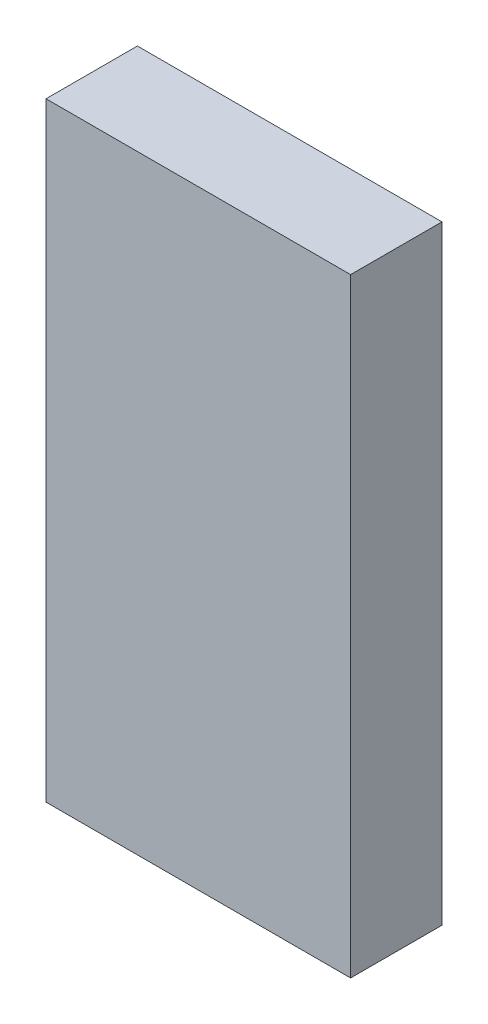
ISO-10303-21;
HEADER;
FILE_DESCRIPTION(('STEP AP214'),'2;1');
FILE_NAME('part.step','',(''),(''),'','','');
FILE_SCHEMA(('AUTOMOTIVE_DESIGN { 1 0 10303 214 1 1 1 1 }'));
ENDSEC;
DATA;
#1=APPLICATION_CONTEXT('core data for automotive mechanical design processes');
#2=APPLICATION_PROTOCOL_DEFINITION('international standard','automotive_design',2000,#1);
#3=PRODUCT_CONTEXT('',#1,'mechanical');
#4=PRODUCT('Part','Part','',(#3));
#5=PRODUCT_RELATED_PRODUCT_CATEGORY('part','',(#4));
#6=PRODUCT_DEFINITION_FORMATION('','',#4);
#7=PRODUCT_DEFINITION_CONTEXT('part definition',#1,'design');
#8=PRODUCT_DEFINITION('design','',#6,#7);
#9=PRODUCT_DEFINITION_SHAPE('','',#8);
#10=(LENGTH_UNIT() NAMED_UNIT(*) SI_UNIT(.MILLI.,.METRE.));
#11=(NAMED_UNIT(*) PLANE_ANGLE_UNIT() SI_UNIT($,.RADIAN.));
#12=(NAMED_UNIT(*) SI_UNIT($,.STERADIAN.) SOLID_ANGLE_UNIT());
#13=UNCERTAINTY_MEASURE_WITH_UNIT(LENGTH_MEASURE(1.E-05),#10,'distance_accuracy_value','');
#14=(GEOMETRIC_REPRESENTATION_CONTEXT(3) GLOBAL_UNCERTAINTY_ASSIGNED_CONTEXT((#13)) GLOBAL_UNIT_ASSIGNED_CONTEXT((#10,
#11,#12)) REPRESENTATION_CONTEXT('',''));
#15=CARTESIAN_POINT('',(0.,0.,0.));
#16=DIRECTION('',(0.,0.,1.));
#17=DIRECTION('',(1.,0.,0.));
#18=AXIS2_PLACEMENT_3D('',#15,#16,#17);
#19=CARTESIAN_POINT('',(12.7,-25.4,7.62));
#20=DIRECTION('',(-1.,0.,0.));
#21=DIRECTION('',(0.,0.,1.));
#22=AXIS2_PLACEMENT_3D('',#19,#20,#21);
#23=PLANE('',#22);
#24=DIRECTION('',(0.,1.,0.));
#25=VECTOR('',#24,1.);
#26=CARTESIAN_POINT('',(12.7,-25.4,0.));
#27=LINE('',#26,#25);
#28=CARTESIAN_POINT('',(12.7,-25.4,0.));
#29=VERTEX_POINT('',#28);
#30=CARTESIAN_POINT('',(12.7,25.4,0.));
#31=VERTEX_POINT('',#30);
#32=EDGE_CURVE('E111',#29,#31,#27,.T.);
#33=ORIENTED_EDGE('',*,*,#32,.T.);
#34=DIRECTION('',(0.,0.,-1.));
#35=VECTOR('',#34,1.);
#36=CARTESIAN_POINT('',(12.7,25.4,7.62));
#37=LINE('',#36,#35);
#38=CARTESIAN_POINT('',(12.7,25.4,7.62));
#39=VERTEX_POINT('',#38);
#40=EDGE_CURVE('E11',#39,#31,#37,.T.);
#41=ORIENTED_EDGE('',*,*,#40,.F.);
#42=DIRECTION('',(0.,1.,0.));
#43=VECTOR('',#42,1.);
#44=CARTESIAN_POINT('',(12.7,-25.4,7.62));
#45=LINE('',#44,#43);
#46=CARTESIAN_POINT('',(12.7,-25.4,7.62));
#47=VERTEX_POINT('',#46);
#48=EDGE_CURVE('E95',#47,#39,#45,.T.);
#49=ORIENTED_EDGE('',*,*,#48,.F.);
#50=DIRECTION('',(0.,0.,-1.));
#51=VECTOR('',#50,1.);
#52=CARTESIAN_POINT('',(12.7,-25.4,7.62));
#53=LINE('',#52,#51);
#54=EDGE_CURVE('E107',#47,#29,#53,.T.);
#55=ORIENTED_EDGE('',*,*,#54,.T.);
#56=EDGE_LOOP('',(#33,#41,#49,#55));
#57=FACE_BOUND('',#56,.T.);
#58=ADVANCED_FACE('F43',(#57),#23,.F.);
#59=CARTESIAN_POINT('',(-12.7,25.4,7.62));
#60=DIRECTION('',(0.,-1.,0.));
#61=DIRECTION('',(0.,0.,-1.));
#62=AXIS2_PLACEMENT_3D('',#59,#60,#61);
#63=PLANE('',#62);
#64=DIRECTION('',(-1.,0.,0.));
#65=VECTOR('',#64,1.);
#66=CARTESIAN_POINT('',(-12.7,25.4,0.));
#67=LINE('',#66,#65);
#68=CARTESIAN_POINT('',(-12.7,25.4,0.));
#69=VERTEX_POINT('',#68);
#70=EDGE_CURVE('E100',#31,#69,#67,.T.);
#71=ORIENTED_EDGE('',*,*,#70,.T.);
#72=DIRECTION('',(0.,0.,-1.));
#73=VECTOR('',#72,1.);
#74=CARTESIAN_POINT('',(-12.7,25.4,7.62));
#75=LINE('',#74,#73);
#76=CARTESIAN_POINT('',(-12.7,25.4,7.62));
#77=VERTEX_POINT('',#76);
#78=EDGE_CURVE('E52',#77,#69,#75,.T.);
#79=ORIENTED_EDGE('',*,*,#78,.F.);
#80=DIRECTION('',(-1.,0.,0.));
#81=VECTOR('',#80,1.);
#82=CARTESIAN_POINT('',(-12.7,25.4,7.62));
#83=LINE('',#82,#81);
#84=EDGE_CURVE('E90',#39,#77,#83,.T.);
#85=ORIENTED_EDGE('',*,*,#84,.F.);
#86=ORIENTED_EDGE('',*,*,#40,.T.);
#87=EDGE_LOOP('',(#71,#79,#85,#86));
#88=FACE_BOUND('',#87,.T.);
#89=ADVANCED_FACE('F99',(#88),#63,.F.);
#90=CARTESIAN_POINT('',(-12.7,-25.4,7.62));
#91=DIRECTION('',(1.,0.,0.));
#92=DIRECTION('',(0.,0.,-1.));
#93=AXIS2_PLACEMENT_3D('',#90,#91,#92);
#94=PLANE('',#93);
#95=DIRECTION('',(0.,-1.,0.));
#96=VECTOR('',#95,1.);
#97=CARTESIAN_POINT('',(-12.7,-25.4,0.));
#98=LINE('',#97,#96);
#99=CARTESIAN_POINT('',(-12.7,-25.4,0.));
#100=VERTEX_POINT('',#99);
#101=EDGE_CURVE('E77',#69,#100,#98,.T.);
#102=ORIENTED_EDGE('',*,*,#101,.T.);
#103=DIRECTION('',(0.,0.,-1.));
#104=VECTOR('',#103,1.);
#105=CARTESIAN_POINT('',(-12.7,-25.4,7.62));
#106=LINE('',#105,#104);
#107=CARTESIAN_POINT('',(-12.7,-25.4,7.62));
#108=VERTEX_POINT('',#107);
#109=EDGE_CURVE('E102',#108,#100,#106,.T.);
#110=ORIENTED_EDGE('',*,*,#109,.F.);
#111=DIRECTION('',(0.,-1.,0.));
#112=VECTOR('',#111,1.);
#113=CARTESIAN_POINT('',(-12.7,-25.4,7.62));
#114=LINE('',#113,#112);
#115=EDGE_CURVE('E93',#77,#108,#114,.T.);
#116=ORIENTED_EDGE('',*,*,#115,.F.);
#117=ORIENTED_EDGE('',*,*,#78,.T.);
#118=EDGE_LOOP('',(#102,#110,#116,#117));
#119=FACE_BOUND('',#118,.T.);
#120=ADVANCED_FACE('F103',(#119),#94,.F.);
#121=CARTESIAN_POINT('',(-12.7,-25.4,7.62));
#122=DIRECTION('',(0.,1.,0.));
#123=DIRECTION('',(0.,0.,1.));
#124=AXIS2_PLACEMENT_3D('',#121,#122,#123);
#125=PLANE('',#124);
#126=DIRECTION('',(1.,0.,0.));
#127=VECTOR('',#126,1.);
#128=CARTESIAN_POINT('',(-12.7,-25.4,0.));
#129=LINE('',#128,#127);
#130=EDGE_CURVE('E83',#100,#29,#129,.T.);
#131=ORIENTED_EDGE('',*,*,#130,.T.);
#132=ORIENTED_EDGE('',*,*,#54,.F.);
#133=DIRECTION('',(1.,0.,0.));
#134=VECTOR('',#133,1.);
#135=CARTESIAN_POINT('',(-12.7,-25.4,7.62));
#136=LINE('',#135,#134);
#137=EDGE_CURVE('E60',#108,#47,#136,.T.);
#138=ORIENTED_EDGE('',*,*,#137,.F.);
#139=ORIENTED_EDGE('',*,*,#109,.T.);
#140=EDGE_LOOP('',(#131,#132,#138,#139));
#141=FACE_BOUND('',#140,.T.);
#142=ADVANCED_FACE('F124',(#141),#125,.F.);
#143=CARTESIAN_POINT('',(0.,0.,7.62));
#144=DIRECTION('',(0.,0.,-1.));
#145=DIRECTION('',(-1.,0.,0.));
#146=AXIS2_PLACEMENT_3D('',#143,#144,#145);
#147=PLANE('',#146);
#148=ORIENTED_EDGE('',*,*,#48,.T.);
#149=ORIENTED_EDGE('',*,*,#84,.T.);
#150=ORIENTED_EDGE('',*,*,#115,.T.);
#151=ORIENTED_EDGE('',*,*,#137,.T.);
#152=EDGE_LOOP('',(#148,#149,#150,#151));
#153=FACE_BOUND('',#152,.T.);
#154=ADVANCED_FACE('F91',(#153),#147,.F.);
#155=CARTESIAN_POINT('',(0.,0.,0.));
#156=DIRECTION('',(0.,0.,-1.));
#157=DIRECTION('',(-1.,0.,0.));
#158=AXIS2_PLACEMENT_3D('',#155,#156,#157);
#159=PLANE('',#158);
#160=ORIENTED_EDGE('',*,*,#32,.F.);
#161=ORIENTED_EDGE('',*,*,#130,.F.);
#162=ORIENTED_EDGE('',*,*,#101,.F.);
#163=ORIENTED_EDGE('',*,*,#70,.F.);
#164=EDGE_LOOP('',(#160,#161,#162,#163));
#165=FACE_BOUND('',#164,.T.);
#166=ADVANCED_FACE('F127',(#165),#159,.T.);
#167=CLOSED_SHELL('',(#58,#89,#120,#142,#154,#166));
#168=MANIFOLD_SOLID_BREP('B2',#167);
#169=ADVANCED_BREP_SHAPE_REPRESENTATION('',(#18,#168),#14);
#170=SHAPE_DEFINITION_REPRESENTATION(#9,#169);
ENDSEC;
END-ISO-10303-21;
